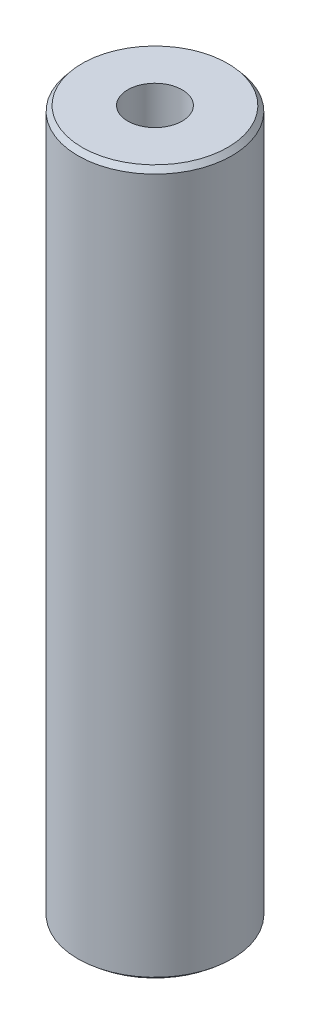
ISO-10303-21;
HEADER;
FILE_DESCRIPTION(('STEP AP214'),'2;1');
FILE_NAME('part.step','',(''),(''),'','','');
FILE_SCHEMA(('AUTOMOTIVE_DESIGN { 1 0 10303 214 1 1 1 1 }'));
ENDSEC;
DATA;
#1=APPLICATION_CONTEXT('core data for automotive mechanical design processes');
#2=APPLICATION_PROTOCOL_DEFINITION('international standard','automotive_design',2000,#1);
#3=PRODUCT_CONTEXT('',#1,'mechanical');
#4=PRODUCT('Part','Part','',(#3));
#5=PRODUCT_RELATED_PRODUCT_CATEGORY('part','',(#4));
#6=PRODUCT_DEFINITION_FORMATION('','',#4);
#7=PRODUCT_DEFINITION_CONTEXT('part definition',#1,'design');
#8=PRODUCT_DEFINITION('design','',#6,#7);
#9=PRODUCT_DEFINITION_SHAPE('','',#8);
#10=(LENGTH_UNIT() NAMED_UNIT(*) SI_UNIT(.MILLI.,.METRE.));
#11=(NAMED_UNIT(*) PLANE_ANGLE_UNIT() SI_UNIT($,.RADIAN.));
#12=(NAMED_UNIT(*) SI_UNIT($,.STERADIAN.) SOLID_ANGLE_UNIT());
#13=UNCERTAINTY_MEASURE_WITH_UNIT(LENGTH_MEASURE(1.E-05),#10,'distance_accuracy_value','');
#14=(GEOMETRIC_REPRESENTATION_CONTEXT(3) GLOBAL_UNCERTAINTY_ASSIGNED_CONTEXT((#13)) GLOBAL_UNIT_ASSIGNED_CONTEXT((#10,
#11,#12)) REPRESENTATION_CONTEXT('',''));
#15=CARTESIAN_POINT('',(0.,0.,0.));
#16=DIRECTION('',(0.,0.,1.));
#17=DIRECTION('',(1.,0.,0.));
#18=AXIS2_PLACEMENT_3D('',#15,#16,#17);
#19=CARTESIAN_POINT('',(0.,205.954816179376,0.));
#20=DIRECTION('',(0.,-1.,0.));
#21=DIRECTION('',(0.,0.,-1.));
#22=AXIS2_PLACEMENT_3D('',#19,#20,#21);
#23=CYLINDRICAL_SURFACE('',#22,22.5);
#24=CARTESIAN_POINT('',(0.,204.467531531258,0.));
#25=DIRECTION('',(0.,1.,0.));
#26=DIRECTION('',(0.,0.,1.));
#27=AXIS2_PLACEMENT_3D('',#24,#25,#26);
#28=CIRCLE('',#27,22.5);
#29=CARTESIAN_POINT('',(0.,204.467531531258,22.5));
#30=VERTEX_POINT('',#29);
#31=EDGE_CURVE('E50',#30,#30,#28,.F.);
#32=ORIENTED_EDGE('',*,*,#31,.T.);
#33=EDGE_LOOP('',(#32));
#34=FACE_BOUND('',#33,.T.);
#35=CARTESIAN_POINT('',(0.,1.23192159049207,0.));
#36=DIRECTION('',(0.,1.,0.));
#37=DIRECTION('',(0.,0.,1.));
#38=AXIS2_PLACEMENT_3D('',#35,#36,#37);
#39=CIRCLE('',#38,22.5);
#40=CARTESIAN_POINT('',(0.,1.23192159049207,22.5));
#41=VERTEX_POINT('',#40);
#42=EDGE_CURVE('E51',#41,#41,#39,.T.);
#43=ORIENTED_EDGE('',*,*,#42,.T.);
#44=EDGE_LOOP('',(#43));
#45=FACE_BOUND('',#44,.T.);
#46=ADVANCED_FACE('F39',(#34,#45),#23,.T.);
#47=CARTESIAN_POINT('',(0.,205.954816179376,0.));
#48=DIRECTION('',(0.,1.,0.));
#49=DIRECTION('',(0.,0.,1.));
#50=AXIS2_PLACEMENT_3D('',#47,#48,#49);
#51=PLANE('',#50);
#52=CARTESIAN_POINT('',(0.,205.954816179376,0.));
#53=DIRECTION('',(0.,1.,0.));
#54=DIRECTION('',(0.,0.,1.));
#55=AXIS2_PLACEMENT_3D('',#52,#53,#54);
#56=CIRCLE('',#55,21.2680784095079);
#57=CARTESIAN_POINT('',(0.,205.954816179376,21.2680784095079));
#58=VERTEX_POINT('',#57);
#59=EDGE_CURVE('E54',#58,#58,#56,.T.);
#60=ORIENTED_EDGE('',*,*,#59,.T.);
#61=EDGE_LOOP('',(#60));
#62=FACE_BOUND('',#61,.T.);
#63=CARTESIAN_POINT('',(0.,205.954816179376,0.));
#64=DIRECTION('',(0.,1.,0.));
#65=DIRECTION('',(0.,0.,1.));
#66=AXIS2_PLACEMENT_3D('',#63,#64,#65);
#67=CIRCLE('',#66,7.94879435412702);
#68=CARTESIAN_POINT('',(0.,205.954816179376,7.94879435412702));
#69=VERTEX_POINT('',#68);
#70=EDGE_CURVE('E58',#69,#69,#67,.T.);
#71=ORIENTED_EDGE('',*,*,#70,.F.);
#72=EDGE_LOOP('',(#71));
#73=FACE_BOUND('',#72,.T.);
#74=ADVANCED_FACE('F69',(#62,#73),#51,.T.);
#75=CARTESIAN_POINT('',(0.,0.,0.));
#76=DIRECTION('',(0.,1.,0.));
#77=DIRECTION('',(0.,0.,1.));
#78=AXIS2_PLACEMENT_3D('',#75,#76,#77);
#79=PLANE('',#78);
#80=CARTESIAN_POINT('',(0.,0.,0.));
#81=DIRECTION('',(0.,1.,0.));
#82=DIRECTION('',(0.,0.,1.));
#83=AXIS2_PLACEMENT_3D('',#80,#81,#82);
#84=CIRCLE('',#83,21.0127153518821);
#85=CARTESIAN_POINT('',(0.,0.,21.0127153518821));
#86=VERTEX_POINT('',#85);
#87=EDGE_CURVE('E10',#86,#86,#84,.F.);
#88=ORIENTED_EDGE('',*,*,#87,.T.);
#89=EDGE_LOOP('',(#88));
#90=FACE_BOUND('',#89,.T.);
#91=CARTESIAN_POINT('',(0.,0.,0.));
#92=DIRECTION('',(0.,1.,0.));
#93=DIRECTION('',(0.,0.,1.));
#94=AXIS2_PLACEMENT_3D('',#91,#92,#93);
#95=CIRCLE('',#94,7.94879435412702);
#96=CARTESIAN_POINT('',(0.,0.,7.94879435412702));
#97=VERTEX_POINT('',#96);
#98=EDGE_CURVE('E63',#97,#97,#95,.T.);
#99=ORIENTED_EDGE('',*,*,#98,.T.);
#100=EDGE_LOOP('',(#99));
#101=FACE_BOUND('',#100,.T.);
#102=ADVANCED_FACE('F75',(#90,#101),#79,.F.);
#103=CARTESIAN_POINT('',(0.,205.954816179376,0.));
#104=DIRECTION('',(0.,-1.,0.));
#105=DIRECTION('',(0.,0.,-1.));
#106=AXIS2_PLACEMENT_3D('',#103,#104,#105);
#107=CYLINDRICAL_SURFACE('',#106,7.94879435412702);
#108=ORIENTED_EDGE('',*,*,#70,.T.);
#109=EDGE_LOOP('',(#108));
#110=FACE_BOUND('',#109,.T.);
#111=ORIENTED_EDGE('',*,*,#98,.F.);
#112=EDGE_LOOP('',(#111));
#113=FACE_BOUND('',#112,.T.);
#114=ADVANCED_FACE('F70',(#110,#113),#107,.F.);
#115=CARTESIAN_POINT('',(0.,205.954816179376,0.));
#116=DIRECTION('',(0.,-1.,0.));
#117=DIRECTION('',(0.,0.,-1.));
#118=AXIS2_PLACEMENT_3D('',#115,#116,#117);
#119=CONICAL_SURFACE('',#118,21.2680784095079,0.691761903790163);
#120=ORIENTED_EDGE('',*,*,#31,.F.);
#121=EDGE_LOOP('',(#120));
#122=FACE_BOUND('',#121,.T.);
#123=ORIENTED_EDGE('',*,*,#59,.F.);
#124=EDGE_LOOP('',(#123));
#125=FACE_BOUND('',#124,.T.);
#126=ADVANCED_FACE('F81',(#122,#125),#119,.T.);
#127=CARTESIAN_POINT('',(0.,1.23192159049207,0.));
#128=DIRECTION('',(0.,1.,0.));
#129=DIRECTION('',(0.,0.,1.));
#130=AXIS2_PLACEMENT_3D('',#127,#128,#129);
#131=CONICAL_SURFACE('',#130,22.5,0.879034423004743);
#132=ORIENTED_EDGE('',*,*,#87,.F.);
#133=EDGE_LOOP('',(#132));
#134=FACE_BOUND('',#133,.T.);
#135=ORIENTED_EDGE('',*,*,#42,.F.);
#136=EDGE_LOOP('',(#135));
#137=FACE_BOUND('',#136,.T.);
#138=ADVANCED_FACE('F45',(#134,#137),#131,.T.);
#139=CLOSED_SHELL('',(#46,#74,#102,#114,#126,#138));
#140=MANIFOLD_SOLID_BREP('B2',#139);
#141=ADVANCED_BREP_SHAPE_REPRESENTATION('',(#18,#140),#14);
#142=SHAPE_DEFINITION_REPRESENTATION(#9,#141);
ENDSEC;
END-ISO-10303-21;
